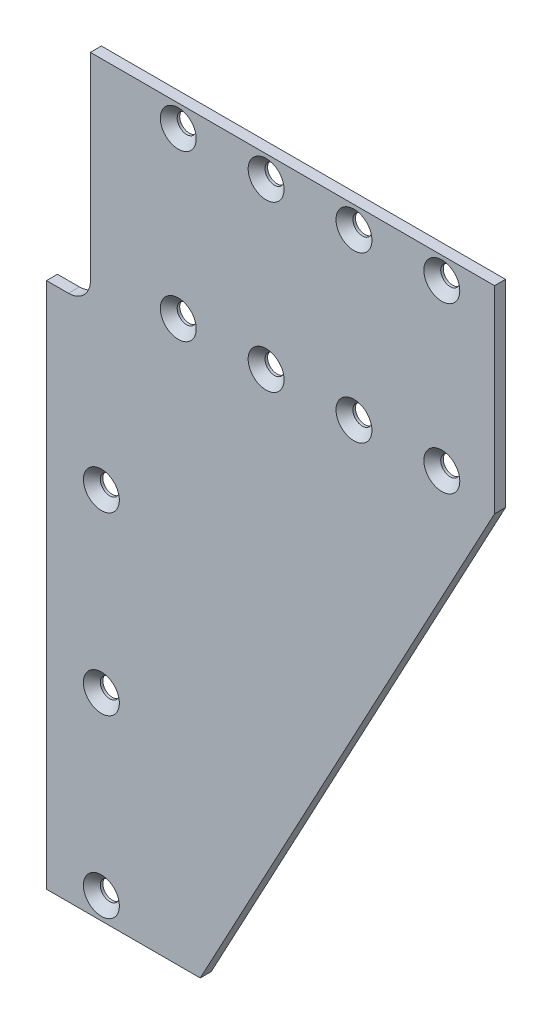
ISO-10303-21;
HEADER;
FILE_DESCRIPTION(('STEP AP214'),'2;1');
FILE_NAME('part.step','',(''),(''),'','','');
FILE_SCHEMA(('AUTOMOTIVE_DESIGN { 1 0 10303 214 1 1 1 1 }'));
ENDSEC;
DATA;
#1=APPLICATION_CONTEXT('core data for automotive mechanical design processes');
#2=APPLICATION_PROTOCOL_DEFINITION('international standard','automotive_design',2000,#1);
#3=PRODUCT_CONTEXT('',#1,'mechanical');
#4=PRODUCT('Part','Part','',(#3));
#5=PRODUCT_RELATED_PRODUCT_CATEGORY('part','',(#4));
#6=PRODUCT_DEFINITION_FORMATION('','',#4);
#7=PRODUCT_DEFINITION_CONTEXT('part definition',#1,'design');
#8=PRODUCT_DEFINITION('design','',#6,#7);
#9=PRODUCT_DEFINITION_SHAPE('','',#8);
#10=(LENGTH_UNIT() NAMED_UNIT(*) SI_UNIT(.MILLI.,.METRE.));
#11=(NAMED_UNIT(*) PLANE_ANGLE_UNIT() SI_UNIT($,.RADIAN.));
#12=(NAMED_UNIT(*) SI_UNIT($,.STERADIAN.) SOLID_ANGLE_UNIT());
#13=UNCERTAINTY_MEASURE_WITH_UNIT(LENGTH_MEASURE(1.E-05),#10,'distance_accuracy_value','');
#14=(GEOMETRIC_REPRESENTATION_CONTEXT(3) GLOBAL_UNCERTAINTY_ASSIGNED_CONTEXT((#13)) GLOBAL_UNIT_ASSIGNED_CONTEXT((#10,
#11,#12)) REPRESENTATION_CONTEXT('',''));
#15=CARTESIAN_POINT('',(0.,0.,0.));
#16=DIRECTION('',(0.,0.,1.));
#17=DIRECTION('',(1.,0.,0.));
#18=AXIS2_PLACEMENT_3D('',#15,#16,#17);
#19=CARTESIAN_POINT('',(6.35,158.75,0.));
#20=DIRECTION('',(0.,0.,-1.));
#21=DIRECTION('',(-1.,0.,0.));
#22=AXIS2_PLACEMENT_3D('',#19,#20,#21);
#23=PLANE('',#22);
#24=CARTESIAN_POINT('',(38.1,209.55,0.));
#25=DIRECTION('',(0.,0.,1.));
#26=DIRECTION('',(1.,0.,0.));
#27=AXIS2_PLACEMENT_3D('',#24,#25,#26);
#28=CIRCLE('',#27,5.1943);
#29=CARTESIAN_POINT('',(43.2943,209.55,0.));
#30=VERTEX_POINT('',#29);
#31=EDGE_CURVE('E366',#30,#30,#28,.T.);
#32=ORIENTED_EDGE('',*,*,#31,.F.);
#33=EDGE_LOOP('',(#32));
#34=FACE_BOUND('',#33,.T.);
#35=CARTESIAN_POINT('',(38.1,161.925,0.));
#36=DIRECTION('',(0.,0.,1.));
#37=DIRECTION('',(1.,0.,0.));
#38=AXIS2_PLACEMENT_3D('',#35,#36,#37);
#39=CIRCLE('',#38,5.1943);
#40=CARTESIAN_POINT('',(43.2943,161.925,0.));
#41=VERTEX_POINT('',#40);
#42=EDGE_CURVE('E375',#41,#41,#39,.T.);
#43=ORIENTED_EDGE('',*,*,#42,.F.);
#44=EDGE_LOOP('',(#43));
#45=FACE_BOUND('',#44,.T.);
#46=DIRECTION('',(1.,0.,0.));
#47=VECTOR('',#46,1.);
#48=CARTESIAN_POINT('',(44.45,0.,0.));
#49=LINE('',#48,#47);
#50=CARTESIAN_POINT('',(0.,0.,0.));
#51=VERTEX_POINT('',#50);
#52=CARTESIAN_POINT('',(44.45,0.,0.));
#53=VERTEX_POINT('',#52);
#54=EDGE_CURVE('E139',#51,#53,#49,.T.);
#55=ORIENTED_EDGE('',*,*,#54,.T.);
#56=DIRECTION('',(0.472417067906652,0.881375126691514,0.));
#57=VECTOR('',#56,1.);
#58=CARTESIAN_POINT('',(129.54,158.75,0.));
#59=LINE('',#58,#57);
#60=CARTESIAN_POINT('',(129.54,158.75,0.));
#61=VERTEX_POINT('',#60);
#62=EDGE_CURVE('E142',#53,#61,#59,.T.);
#63=ORIENTED_EDGE('',*,*,#62,.T.);
#64=DIRECTION('',(0.,1.,0.));
#65=VECTOR('',#64,1.);
#66=CARTESIAN_POINT('',(129.54,215.9,0.));
#67=LINE('',#66,#65);
#68=CARTESIAN_POINT('',(129.54,215.9,0.));
#69=VERTEX_POINT('',#68);
#70=EDGE_CURVE('E146',#61,#69,#67,.T.);
#71=ORIENTED_EDGE('',*,*,#70,.T.);
#72=DIRECTION('',(-1.,0.,0.));
#73=VECTOR('',#72,1.);
#74=CARTESIAN_POINT('',(12.7,215.9,0.));
#75=LINE('',#74,#73);
#76=CARTESIAN_POINT('',(12.7,215.9,0.));
#77=VERTEX_POINT('',#76);
#78=EDGE_CURVE('E149',#69,#77,#75,.T.);
#79=ORIENTED_EDGE('',*,*,#78,.T.);
#80=DIRECTION('',(0.,-1.,0.));
#81=VECTOR('',#80,1.);
#82=CARTESIAN_POINT('',(12.7,215.9,0.));
#83=LINE('',#82,#81);
#84=CARTESIAN_POINT('',(12.7,158.75,0.));
#85=VERTEX_POINT('',#84);
#86=EDGE_CURVE('E152',#77,#85,#83,.T.);
#87=ORIENTED_EDGE('',*,*,#86,.T.);
#88=CARTESIAN_POINT('',(6.35,158.75,0.));
#89=DIRECTION('',(0.,0.,-1.));
#90=DIRECTION('',(-1.,0.,0.));
#91=AXIS2_PLACEMENT_3D('',#88,#89,#90);
#92=CIRCLE('',#91,6.35);
#93=CARTESIAN_POINT('',(6.34999999999994,152.4,0.));
#94=VERTEX_POINT('',#93);
#95=EDGE_CURVE('E155',#85,#94,#92,.T.);
#96=ORIENTED_EDGE('',*,*,#95,.T.);
#97=DIRECTION('',(-1.,0.,0.));
#98=VECTOR('',#97,1.);
#99=CARTESIAN_POINT('',(6.34999999999994,152.4,0.));
#100=LINE('',#99,#98);
#101=CARTESIAN_POINT('',(0.,152.4,0.));
#102=VERTEX_POINT('',#101);
#103=EDGE_CURVE('E115',#94,#102,#100,.T.);
#104=ORIENTED_EDGE('',*,*,#103,.T.);
#105=DIRECTION('',(0.,-1.,0.));
#106=VECTOR('',#105,1.);
#107=CARTESIAN_POINT('',(0.,0.,0.));
#108=LINE('',#107,#106);
#109=EDGE_CURVE('E158',#102,#51,#108,.T.);
#110=ORIENTED_EDGE('',*,*,#109,.T.);
#111=EDGE_LOOP('',(#55,#63,#71,#79,#87,#96,#104,#110));
#112=FACE_BOUND('',#111,.T.);
#113=CARTESIAN_POINT('',(63.5,161.925,0.));
#114=DIRECTION('',(0.,0.,1.));
#115=DIRECTION('',(1.,0.,0.));
#116=AXIS2_PLACEMENT_3D('',#113,#114,#115);
#117=CIRCLE('',#116,5.1943);
#118=CARTESIAN_POINT('',(68.6943,161.925,0.));
#119=VERTEX_POINT('',#118);
#120=EDGE_CURVE('E357',#119,#119,#117,.T.);
#121=ORIENTED_EDGE('',*,*,#120,.F.);
#122=EDGE_LOOP('',(#121));
#123=FACE_BOUND('',#122,.T.);
#124=CARTESIAN_POINT('',(63.5,209.55,0.));
#125=DIRECTION('',(0.,0.,1.));
#126=DIRECTION('',(1.,0.,0.));
#127=AXIS2_PLACEMENT_3D('',#124,#125,#126);
#128=CIRCLE('',#127,5.1943);
#129=CARTESIAN_POINT('',(68.6943,209.55,0.));
#130=VERTEX_POINT('',#129);
#131=EDGE_CURVE('E348',#130,#130,#128,.T.);
#132=ORIENTED_EDGE('',*,*,#131,.F.);
#133=EDGE_LOOP('',(#132));
#134=FACE_BOUND('',#133,.T.);
#135=CARTESIAN_POINT('',(88.9,161.925,0.));
#136=DIRECTION('',(0.,0.,1.));
#137=DIRECTION('',(1.,0.,0.));
#138=AXIS2_PLACEMENT_3D('',#135,#136,#137);
#139=CIRCLE('',#138,5.1943);
#140=CARTESIAN_POINT('',(94.0943,161.925,0.));
#141=VERTEX_POINT('',#140);
#142=EDGE_CURVE('E339',#141,#141,#139,.T.);
#143=ORIENTED_EDGE('',*,*,#142,.F.);
#144=EDGE_LOOP('',(#143));
#145=FACE_BOUND('',#144,.T.);
#146=CARTESIAN_POINT('',(88.9,209.55,0.));
#147=DIRECTION('',(0.,0.,1.));
#148=DIRECTION('',(1.,0.,0.));
#149=AXIS2_PLACEMENT_3D('',#146,#147,#148);
#150=CIRCLE('',#149,5.1943);
#151=CARTESIAN_POINT('',(94.0943,209.55,0.));
#152=VERTEX_POINT('',#151);
#153=EDGE_CURVE('E330',#152,#152,#150,.T.);
#154=ORIENTED_EDGE('',*,*,#153,.F.);
#155=EDGE_LOOP('',(#154));
#156=FACE_BOUND('',#155,.T.);
#157=CARTESIAN_POINT('',(114.3,161.925,0.));
#158=DIRECTION('',(0.,0.,1.));
#159=DIRECTION('',(1.,0.,0.));
#160=AXIS2_PLACEMENT_3D('',#157,#158,#159);
#161=CIRCLE('',#160,5.1943);
#162=CARTESIAN_POINT('',(119.4943,161.925,0.));
#163=VERTEX_POINT('',#162);
#164=EDGE_CURVE('E321',#163,#163,#161,.T.);
#165=ORIENTED_EDGE('',*,*,#164,.F.);
#166=EDGE_LOOP('',(#165));
#167=FACE_BOUND('',#166,.T.);
#168=CARTESIAN_POINT('',(114.3,209.55,0.));
#169=DIRECTION('',(0.,0.,1.));
#170=DIRECTION('',(1.,0.,0.));
#171=AXIS2_PLACEMENT_3D('',#168,#169,#170);
#172=CIRCLE('',#171,5.1943);
#173=CARTESIAN_POINT('',(119.4943,209.55,0.));
#174=VERTEX_POINT('',#173);
#175=EDGE_CURVE('E312',#174,#174,#172,.T.);
#176=ORIENTED_EDGE('',*,*,#175,.F.);
#177=EDGE_LOOP('',(#176));
#178=FACE_BOUND('',#177,.T.);
#179=CARTESIAN_POINT('',(15.875,107.95,0.));
#180=DIRECTION('',(0.,0.,1.));
#181=DIRECTION('',(1.,0.,0.));
#182=AXIS2_PLACEMENT_3D('',#179,#180,#181);
#183=CIRCLE('',#182,5.1943);
#184=CARTESIAN_POINT('',(21.0693,107.95,0.));
#185=VERTEX_POINT('',#184);
#186=EDGE_CURVE('E303',#185,#185,#183,.T.);
#187=ORIENTED_EDGE('',*,*,#186,.F.);
#188=EDGE_LOOP('',(#187));
#189=FACE_BOUND('',#188,.T.);
#190=CARTESIAN_POINT('',(15.875,57.15,0.));
#191=DIRECTION('',(0.,0.,1.));
#192=DIRECTION('',(1.,0.,0.));
#193=AXIS2_PLACEMENT_3D('',#190,#191,#192);
#194=CIRCLE('',#193,5.1943);
#195=CARTESIAN_POINT('',(21.0693,57.15,0.));
#196=VERTEX_POINT('',#195);
#197=EDGE_CURVE('E294',#196,#196,#194,.T.);
#198=ORIENTED_EDGE('',*,*,#197,.F.);
#199=EDGE_LOOP('',(#198));
#200=FACE_BOUND('',#199,.T.);
#201=CARTESIAN_POINT('',(15.875,6.34999999999999,0.));
#202=DIRECTION('',(0.,0.,1.));
#203=DIRECTION('',(1.,0.,0.));
#204=AXIS2_PLACEMENT_3D('',#201,#202,#203);
#205=CIRCLE('',#204,5.1943);
#206=CARTESIAN_POINT('',(21.0693,6.34999999999999,0.));
#207=VERTEX_POINT('',#206);
#208=EDGE_CURVE('E286',#207,#207,#205,.T.);
#209=ORIENTED_EDGE('',*,*,#208,.F.);
#210=EDGE_LOOP('',(#209));
#211=FACE_BOUND('',#210,.T.);
#212=ADVANCED_FACE('F40',(#34,#45,#112,#123,#134,#145,#156,#167,#178,#189,#200,#211),#23,.F.);
#213=CARTESIAN_POINT('',(6.35,158.75,-3.175));
#214=DIRECTION('',(0.,0.,-1.));
#215=DIRECTION('',(-1.,0.,0.));
#216=AXIS2_PLACEMENT_3D('',#213,#214,#215);
#217=PLANE('',#216);
#218=CARTESIAN_POINT('',(114.3,161.925,-3.175));
#219=DIRECTION('',(0.,0.,1.));
#220=DIRECTION('',(1.,0.,0.));
#221=AXIS2_PLACEMENT_3D('',#218,#219,#220);
#222=CIRCLE('',#221,2.75590000000001);
#223=CARTESIAN_POINT('',(117.0559,161.925,-3.175));
#224=VERTEX_POINT('',#223);
#225=EDGE_CURVE('E327',#224,#224,#222,.T.);
#226=ORIENTED_EDGE('',*,*,#225,.T.);
#227=EDGE_LOOP('',(#226));
#228=FACE_BOUND('',#227,.T.);
#229=DIRECTION('',(1.,0.,0.));
#230=VECTOR('',#229,1.);
#231=CARTESIAN_POINT('',(44.45,0.,-3.175));
#232=LINE('',#231,#230);
#233=CARTESIAN_POINT('',(0.,0.,-3.175));
#234=VERTEX_POINT('',#233);
#235=CARTESIAN_POINT('',(44.45,0.,-3.175));
#236=VERTEX_POINT('',#235);
#237=EDGE_CURVE('E160',#234,#236,#232,.T.);
#238=ORIENTED_EDGE('',*,*,#237,.F.);
#239=DIRECTION('',(0.,-1.,0.));
#240=VECTOR('',#239,1.);
#241=CARTESIAN_POINT('',(0.,0.,-3.175));
#242=LINE('',#241,#240);
#243=CARTESIAN_POINT('',(0.,152.4,-3.175));
#244=VERTEX_POINT('',#243);
#245=EDGE_CURVE('E129',#244,#234,#242,.T.);
#246=ORIENTED_EDGE('',*,*,#245,.F.);
#247=DIRECTION('',(-1.,0.,0.));
#248=VECTOR('',#247,1.);
#249=CARTESIAN_POINT('',(6.34999999999994,152.4,-3.175));
#250=LINE('',#249,#248);
#251=CARTESIAN_POINT('',(6.34999999999994,152.4,-3.175));
#252=VERTEX_POINT('',#251);
#253=EDGE_CURVE('E113',#252,#244,#250,.T.);
#254=ORIENTED_EDGE('',*,*,#253,.F.);
#255=CARTESIAN_POINT('',(6.35,158.75,-3.175));
#256=DIRECTION('',(0.,0.,-1.));
#257=DIRECTION('',(-1.,0.,0.));
#258=AXIS2_PLACEMENT_3D('',#255,#256,#257);
#259=CIRCLE('',#258,6.35);
#260=CARTESIAN_POINT('',(12.7,158.75,-3.175));
#261=VERTEX_POINT('',#260);
#262=EDGE_CURVE('E127',#261,#252,#259,.T.);
#263=ORIENTED_EDGE('',*,*,#262,.F.);
#264=DIRECTION('',(0.,-1.,0.));
#265=VECTOR('',#264,1.);
#266=CARTESIAN_POINT('',(12.7,215.9,-3.175));
#267=LINE('',#266,#265);
#268=CARTESIAN_POINT('',(12.7,215.9,-3.175));
#269=VERTEX_POINT('',#268);
#270=EDGE_CURVE('E132',#269,#261,#267,.T.);
#271=ORIENTED_EDGE('',*,*,#270,.F.);
#272=DIRECTION('',(-1.,0.,0.));
#273=VECTOR('',#272,1.);
#274=CARTESIAN_POINT('',(12.7,215.9,-3.175));
#275=LINE('',#274,#273);
#276=CARTESIAN_POINT('',(129.54,215.9,-3.175));
#277=VERTEX_POINT('',#276);
#278=EDGE_CURVE('E134',#277,#269,#275,.T.);
#279=ORIENTED_EDGE('',*,*,#278,.F.);
#280=DIRECTION('',(0.,1.,0.));
#281=VECTOR('',#280,1.);
#282=CARTESIAN_POINT('',(129.54,215.9,-3.175));
#283=LINE('',#282,#281);
#284=CARTESIAN_POINT('',(129.54,158.75,-3.175));
#285=VERTEX_POINT('',#284);
#286=EDGE_CURVE('E386',#285,#277,#283,.T.);
#287=ORIENTED_EDGE('',*,*,#286,.F.);
#288=DIRECTION('',(0.472417067906652,0.881375126691514,0.));
#289=VECTOR('',#288,1.);
#290=CARTESIAN_POINT('',(129.54,158.75,-3.175));
#291=LINE('',#290,#289);
#292=EDGE_CURVE('E384',#236,#285,#291,.T.);
#293=ORIENTED_EDGE('',*,*,#292,.F.);
#294=EDGE_LOOP('',(#238,#246,#254,#263,#271,#279,#287,#293));
#295=FACE_BOUND('',#294,.T.);
#296=CARTESIAN_POINT('',(38.1,161.925,-3.175));
#297=DIRECTION('',(0.,0.,1.));
#298=DIRECTION('',(1.,0.,0.));
#299=AXIS2_PLACEMENT_3D('',#296,#297,#298);
#300=CIRCLE('',#299,2.7559);
#301=CARTESIAN_POINT('',(40.8559,161.925,-3.175));
#302=VERTEX_POINT('',#301);
#303=EDGE_CURVE('E143',#302,#302,#300,.T.);
#304=ORIENTED_EDGE('',*,*,#303,.T.);
#305=EDGE_LOOP('',(#304));
#306=FACE_BOUND('',#305,.T.);
#307=CARTESIAN_POINT('',(38.1,209.55,-3.175));
#308=DIRECTION('',(0.,0.,1.));
#309=DIRECTION('',(1.,0.,0.));
#310=AXIS2_PLACEMENT_3D('',#307,#308,#309);
#311=CIRCLE('',#310,2.7559);
#312=CARTESIAN_POINT('',(40.8559,209.55,-3.175));
#313=VERTEX_POINT('',#312);
#314=EDGE_CURVE('E372',#313,#313,#311,.T.);
#315=ORIENTED_EDGE('',*,*,#314,.T.);
#316=EDGE_LOOP('',(#315));
#317=FACE_BOUND('',#316,.T.);
#318=CARTESIAN_POINT('',(63.5,161.925,-3.175));
#319=DIRECTION('',(0.,0.,1.));
#320=DIRECTION('',(1.,0.,0.));
#321=AXIS2_PLACEMENT_3D('',#318,#319,#320);
#322=CIRCLE('',#321,2.75590000000001);
#323=CARTESIAN_POINT('',(66.2559,161.925,-3.175));
#324=VERTEX_POINT('',#323);
#325=EDGE_CURVE('E363',#324,#324,#322,.T.);
#326=ORIENTED_EDGE('',*,*,#325,.T.);
#327=EDGE_LOOP('',(#326));
#328=FACE_BOUND('',#327,.T.);
#329=CARTESIAN_POINT('',(63.5,209.55,-3.175));
#330=DIRECTION('',(0.,0.,1.));
#331=DIRECTION('',(1.,0.,0.));
#332=AXIS2_PLACEMENT_3D('',#329,#330,#331);
#333=CIRCLE('',#332,2.75590000000001);
#334=CARTESIAN_POINT('',(66.2559,209.55,-3.175));
#335=VERTEX_POINT('',#334);
#336=EDGE_CURVE('E354',#335,#335,#333,.T.);
#337=ORIENTED_EDGE('',*,*,#336,.T.);
#338=EDGE_LOOP('',(#337));
#339=FACE_BOUND('',#338,.T.);
#340=CARTESIAN_POINT('',(88.9,161.925,-3.175));
#341=DIRECTION('',(0.,0.,1.));
#342=DIRECTION('',(1.,0.,0.));
#343=AXIS2_PLACEMENT_3D('',#340,#341,#342);
#344=CIRCLE('',#343,2.75590000000001);
#345=CARTESIAN_POINT('',(91.6559,161.925,-3.175));
#346=VERTEX_POINT('',#345);
#347=EDGE_CURVE('E345',#346,#346,#344,.T.);
#348=ORIENTED_EDGE('',*,*,#347,.T.);
#349=EDGE_LOOP('',(#348));
#350=FACE_BOUND('',#349,.T.);
#351=CARTESIAN_POINT('',(88.9,209.55,-3.175));
#352=DIRECTION('',(0.,0.,1.));
#353=DIRECTION('',(1.,0.,0.));
#354=AXIS2_PLACEMENT_3D('',#351,#352,#353);
#355=CIRCLE('',#354,2.75590000000001);
#356=CARTESIAN_POINT('',(91.6559,209.55,-3.175));
#357=VERTEX_POINT('',#356);
#358=EDGE_CURVE('E336',#357,#357,#355,.T.);
#359=ORIENTED_EDGE('',*,*,#358,.T.);
#360=EDGE_LOOP('',(#359));
#361=FACE_BOUND('',#360,.T.);
#362=CARTESIAN_POINT('',(114.3,209.55,-3.175));
#363=DIRECTION('',(0.,0.,1.));
#364=DIRECTION('',(1.,0.,0.));
#365=AXIS2_PLACEMENT_3D('',#362,#363,#364);
#366=CIRCLE('',#365,2.75590000000001);
#367=CARTESIAN_POINT('',(117.0559,209.55,-3.175));
#368=VERTEX_POINT('',#367);
#369=EDGE_CURVE('E318',#368,#368,#366,.T.);
#370=ORIENTED_EDGE('',*,*,#369,.T.);
#371=EDGE_LOOP('',(#370));
#372=FACE_BOUND('',#371,.T.);
#373=CARTESIAN_POINT('',(15.875,107.95,-3.175));
#374=DIRECTION('',(0.,0.,1.));
#375=DIRECTION('',(1.,0.,0.));
#376=AXIS2_PLACEMENT_3D('',#373,#374,#375);
#377=CIRCLE('',#376,2.75589999999999);
#378=CARTESIAN_POINT('',(18.6309,107.95,-3.175));
#379=VERTEX_POINT('',#378);
#380=EDGE_CURVE('E309',#379,#379,#377,.T.);
#381=ORIENTED_EDGE('',*,*,#380,.T.);
#382=EDGE_LOOP('',(#381));
#383=FACE_BOUND('',#382,.T.);
#384=CARTESIAN_POINT('',(15.875,57.15,-3.175));
#385=DIRECTION('',(0.,0.,1.));
#386=DIRECTION('',(1.,0.,0.));
#387=AXIS2_PLACEMENT_3D('',#384,#385,#386);
#388=CIRCLE('',#387,2.75589999999999);
#389=CARTESIAN_POINT('',(18.6309,57.15,-3.175));
#390=VERTEX_POINT('',#389);
#391=EDGE_CURVE('E300',#390,#390,#388,.T.);
#392=ORIENTED_EDGE('',*,*,#391,.T.);
#393=EDGE_LOOP('',(#392));
#394=FACE_BOUND('',#393,.T.);
#395=CARTESIAN_POINT('',(15.875,6.34999999999999,-3.175));
#396=DIRECTION('',(0.,0.,1.));
#397=DIRECTION('',(1.,0.,0.));
#398=AXIS2_PLACEMENT_3D('',#395,#396,#397);
#399=CIRCLE('',#398,2.75589999999999);
#400=CARTESIAN_POINT('',(18.6309,6.34999999999999,-3.175));
#401=VERTEX_POINT('',#400);
#402=EDGE_CURVE('E289',#401,#401,#399,.T.);
#403=ORIENTED_EDGE('',*,*,#402,.T.);
#404=EDGE_LOOP('',(#403));
#405=FACE_BOUND('',#404,.T.);
#406=ADVANCED_FACE('F124',(#228,#295,#306,#317,#328,#339,#350,#361,#372,#383,#394,#405),#217,.T.);
#407=CARTESIAN_POINT('',(44.45,0.,-3.175));
#408=DIRECTION('',(0.,-1.,0.));
#409=DIRECTION('',(0.,0.,-1.));
#410=AXIS2_PLACEMENT_3D('',#407,#408,#409);
#411=PLANE('',#410);
#412=ORIENTED_EDGE('',*,*,#54,.F.);
#413=DIRECTION('',(0.,0.,1.));
#414=VECTOR('',#413,1.);
#415=CARTESIAN_POINT('',(0.,0.,-3.175));
#416=LINE('',#415,#414);
#417=EDGE_CURVE('E11',#234,#51,#416,.T.);
#418=ORIENTED_EDGE('',*,*,#417,.F.);
#419=ORIENTED_EDGE('',*,*,#237,.T.);
#420=DIRECTION('',(0.,0.,1.));
#421=VECTOR('',#420,1.);
#422=CARTESIAN_POINT('',(44.45,0.,-3.175));
#423=LINE('',#422,#421);
#424=EDGE_CURVE('E44',#236,#53,#423,.T.);
#425=ORIENTED_EDGE('',*,*,#424,.T.);
#426=EDGE_LOOP('',(#412,#418,#419,#425));
#427=FACE_BOUND('',#426,.T.);
#428=ADVANCED_FACE('F42',(#427),#411,.T.);
#429=CARTESIAN_POINT('',(0.,0.,-3.175));
#430=DIRECTION('',(-1.,0.,0.));
#431=DIRECTION('',(0.,0.,1.));
#432=AXIS2_PLACEMENT_3D('',#429,#430,#431);
#433=PLANE('',#432);
#434=ORIENTED_EDGE('',*,*,#109,.F.);
#435=DIRECTION('',(0.,0.,1.));
#436=VECTOR('',#435,1.);
#437=CARTESIAN_POINT('',(0.,152.4,-3.175));
#438=LINE('',#437,#436);
#439=EDGE_CURVE('E50',#244,#102,#438,.T.);
#440=ORIENTED_EDGE('',*,*,#439,.F.);
#441=ORIENTED_EDGE('',*,*,#245,.T.);
#442=ORIENTED_EDGE('',*,*,#417,.T.);
#443=EDGE_LOOP('',(#434,#440,#441,#442));
#444=FACE_BOUND('',#443,.T.);
#445=ADVANCED_FACE('F172',(#444),#433,.T.);
#446=CARTESIAN_POINT('',(6.34999999999994,152.4,-3.175));
#447=DIRECTION('',(0.,1.,0.));
#448=DIRECTION('',(0.,0.,1.));
#449=AXIS2_PLACEMENT_3D('',#446,#447,#448);
#450=PLANE('',#449);
#451=ORIENTED_EDGE('',*,*,#103,.F.);
#452=DIRECTION('',(0.,0.,1.));
#453=VECTOR('',#452,1.);
#454=CARTESIAN_POINT('',(6.34999999999994,152.4,-3.175));
#455=LINE('',#454,#453);
#456=EDGE_CURVE('E110',#252,#94,#455,.T.);
#457=ORIENTED_EDGE('',*,*,#456,.F.);
#458=ORIENTED_EDGE('',*,*,#253,.T.);
#459=ORIENTED_EDGE('',*,*,#439,.T.);
#460=EDGE_LOOP('',(#451,#457,#458,#459));
#461=FACE_BOUND('',#460,.T.);
#462=ADVANCED_FACE('F112',(#461),#450,.T.);
#463=CARTESIAN_POINT('',(6.35,158.75,-3.175));
#464=DIRECTION('',(0.,0.,1.));
#465=DIRECTION('',(1.,0.,0.));
#466=AXIS2_PLACEMENT_3D('',#463,#464,#465);
#467=CYLINDRICAL_SURFACE('',#466,6.35);
#468=ORIENTED_EDGE('',*,*,#95,.F.);
#469=DIRECTION('',(0.,0.,1.));
#470=VECTOR('',#469,1.);
#471=CARTESIAN_POINT('',(12.7,158.75,-3.175));
#472=LINE('',#471,#470);
#473=EDGE_CURVE('E120',#261,#85,#472,.T.);
#474=ORIENTED_EDGE('',*,*,#473,.F.);
#475=ORIENTED_EDGE('',*,*,#262,.T.);
#476=ORIENTED_EDGE('',*,*,#456,.T.);
#477=EDGE_LOOP('',(#468,#474,#475,#476));
#478=FACE_BOUND('',#477,.T.);
#479=ADVANCED_FACE('F131',(#478),#467,.F.);
#480=CARTESIAN_POINT('',(12.7,215.9,-3.175));
#481=DIRECTION('',(-1.,0.,0.));
#482=DIRECTION('',(0.,-1.,0.));
#483=AXIS2_PLACEMENT_3D('',#480,#481,#482);
#484=PLANE('',#483);
#485=ORIENTED_EDGE('',*,*,#86,.F.);
#486=DIRECTION('',(0.,0.,1.));
#487=VECTOR('',#486,1.);
#488=CARTESIAN_POINT('',(12.7,215.9,-3.175));
#489=LINE('',#488,#487);
#490=EDGE_CURVE('E164',#269,#77,#489,.T.);
#491=ORIENTED_EDGE('',*,*,#490,.F.);
#492=ORIENTED_EDGE('',*,*,#270,.T.);
#493=ORIENTED_EDGE('',*,*,#473,.T.);
#494=EDGE_LOOP('',(#485,#491,#492,#493));
#495=FACE_BOUND('',#494,.T.);
#496=ADVANCED_FACE('F398',(#495),#484,.T.);
#497=CARTESIAN_POINT('',(12.7,215.9,-3.175));
#498=DIRECTION('',(0.,1.,0.));
#499=DIRECTION('',(-1.,0.,0.));
#500=AXIS2_PLACEMENT_3D('',#497,#498,#499);
#501=PLANE('',#500);
#502=ORIENTED_EDGE('',*,*,#78,.F.);
#503=DIRECTION('',(0.,0.,1.));
#504=VECTOR('',#503,1.);
#505=CARTESIAN_POINT('',(129.54,215.9,-3.175));
#506=LINE('',#505,#504);
#507=EDGE_CURVE('E166',#277,#69,#506,.T.);
#508=ORIENTED_EDGE('',*,*,#507,.F.);
#509=ORIENTED_EDGE('',*,*,#278,.T.);
#510=ORIENTED_EDGE('',*,*,#490,.T.);
#511=EDGE_LOOP('',(#502,#508,#509,#510));
#512=FACE_BOUND('',#511,.T.);
#513=ADVANCED_FACE('F392',(#512),#501,.T.);
#514=CARTESIAN_POINT('',(129.54,215.9,-3.175));
#515=DIRECTION('',(1.,0.,0.));
#516=DIRECTION('',(0.,1.,0.));
#517=AXIS2_PLACEMENT_3D('',#514,#515,#516);
#518=PLANE('',#517);
#519=ORIENTED_EDGE('',*,*,#70,.F.);
#520=DIRECTION('',(0.,0.,1.));
#521=VECTOR('',#520,1.);
#522=CARTESIAN_POINT('',(129.54,158.75,-3.175));
#523=LINE('',#522,#521);
#524=EDGE_CURVE('E167',#285,#61,#523,.T.);
#525=ORIENTED_EDGE('',*,*,#524,.F.);
#526=ORIENTED_EDGE('',*,*,#286,.T.);
#527=ORIENTED_EDGE('',*,*,#507,.T.);
#528=EDGE_LOOP('',(#519,#525,#526,#527));
#529=FACE_BOUND('',#528,.T.);
#530=ADVANCED_FACE('F396',(#529),#518,.T.);
#531=CARTESIAN_POINT('',(129.54,158.75,-3.175));
#532=DIRECTION('',(0.881375126691514,-0.472417067906652,0.));
#533=DIRECTION('',(0.472417067906652,0.881375126691514,0.));
#534=AXIS2_PLACEMENT_3D('',#531,#532,#533);
#535=PLANE('',#534);
#536=ORIENTED_EDGE('',*,*,#62,.F.);
#537=ORIENTED_EDGE('',*,*,#424,.F.);
#538=ORIENTED_EDGE('',*,*,#292,.T.);
#539=ORIENTED_EDGE('',*,*,#524,.T.);
#540=EDGE_LOOP('',(#536,#537,#538,#539));
#541=FACE_BOUND('',#540,.T.);
#542=ADVANCED_FACE('F169',(#541),#535,.T.);
#543=CARTESIAN_POINT('',(38.1,161.925,0.));
#544=DIRECTION('',(0.,0.,1.));
#545=DIRECTION('',(1.,0.,0.));
#546=AXIS2_PLACEMENT_3D('',#543,#544,#545);
#547=CYLINDRICAL_SURFACE('',#546,2.7559);
#548=ORIENTED_EDGE('',*,*,#303,.F.);
#549=EDGE_LOOP('',(#548));
#550=FACE_BOUND('',#549,.T.);
#551=CARTESIAN_POINT('',(38.1,161.925,-2.4384));
#552=DIRECTION('',(0.,0.,1.));
#553=DIRECTION('',(1.,0.,0.));
#554=AXIS2_PLACEMENT_3D('',#551,#552,#553);
#555=CIRCLE('',#554,2.7559);
#556=CARTESIAN_POINT('',(40.8559,161.925,-2.4384));
#557=VERTEX_POINT('',#556);
#558=EDGE_CURVE('E378',#557,#557,#555,.T.);
#559=ORIENTED_EDGE('',*,*,#558,.T.);
#560=EDGE_LOOP('',(#559));
#561=FACE_BOUND('',#560,.T.);
#562=ADVANCED_FACE('F191',(#550,#561),#547,.F.);
#563=CARTESIAN_POINT('',(38.1,161.925,0.));
#564=DIRECTION('',(0.,0.,1.));
#565=DIRECTION('',(1.,0.,0.));
#566=AXIS2_PLACEMENT_3D('',#563,#564,#565);
#567=CONICAL_SURFACE('',#566,5.1943,0.785398163397449);
#568=ORIENTED_EDGE('',*,*,#558,.F.);
#569=EDGE_LOOP('',(#568));
#570=FACE_BOUND('',#569,.T.);
#571=ORIENTED_EDGE('',*,*,#42,.T.);
#572=EDGE_LOOP('',(#571));
#573=FACE_BOUND('',#572,.T.);
#574=ADVANCED_FACE('F194',(#570,#573),#567,.F.);
#575=CARTESIAN_POINT('',(38.1,209.55,0.));
#576=DIRECTION('',(0.,0.,1.));
#577=DIRECTION('',(1.,0.,0.));
#578=AXIS2_PLACEMENT_3D('',#575,#576,#577);
#579=CYLINDRICAL_SURFACE('',#578,2.7559);
#580=ORIENTED_EDGE('',*,*,#314,.F.);
#581=EDGE_LOOP('',(#580));
#582=FACE_BOUND('',#581,.T.);
#583=CARTESIAN_POINT('',(38.1,209.55,-2.4384));
#584=DIRECTION('',(0.,0.,1.));
#585=DIRECTION('',(1.,0.,0.));
#586=AXIS2_PLACEMENT_3D('',#583,#584,#585);
#587=CIRCLE('',#586,2.7559);
#588=CARTESIAN_POINT('',(40.8559,209.55,-2.4384));
#589=VERTEX_POINT('',#588);
#590=EDGE_CURVE('E369',#589,#589,#587,.T.);
#591=ORIENTED_EDGE('',*,*,#590,.T.);
#592=EDGE_LOOP('',(#591));
#593=FACE_BOUND('',#592,.T.);
#594=ADVANCED_FACE('F198',(#582,#593),#579,.F.);
#595=CARTESIAN_POINT('',(38.1,209.55,0.));
#596=DIRECTION('',(0.,0.,1.));
#597=DIRECTION('',(1.,0.,0.));
#598=AXIS2_PLACEMENT_3D('',#595,#596,#597);
#599=CONICAL_SURFACE('',#598,5.1943,0.785398163397449);
#600=ORIENTED_EDGE('',*,*,#590,.F.);
#601=EDGE_LOOP('',(#600));
#602=FACE_BOUND('',#601,.T.);
#603=ORIENTED_EDGE('',*,*,#31,.T.);
#604=EDGE_LOOP('',(#603));
#605=FACE_BOUND('',#604,.T.);
#606=ADVANCED_FACE('F202',(#602,#605),#599,.F.);
#607=CARTESIAN_POINT('',(63.5,161.925,0.));
#608=DIRECTION('',(0.,0.,1.));
#609=DIRECTION('',(1.,0.,0.));
#610=AXIS2_PLACEMENT_3D('',#607,#608,#609);
#611=CYLINDRICAL_SURFACE('',#610,2.75590000000001);
#612=ORIENTED_EDGE('',*,*,#325,.F.);
#613=EDGE_LOOP('',(#612));
#614=FACE_BOUND('',#613,.T.);
#615=CARTESIAN_POINT('',(63.5,161.925,-2.4384));
#616=DIRECTION('',(0.,0.,1.));
#617=DIRECTION('',(1.,0.,0.));
#618=AXIS2_PLACEMENT_3D('',#615,#616,#617);
#619=CIRCLE('',#618,2.75590000000001);
#620=CARTESIAN_POINT('',(66.2559,161.925,-2.4384));
#621=VERTEX_POINT('',#620);
#622=EDGE_CURVE('E360',#621,#621,#619,.T.);
#623=ORIENTED_EDGE('',*,*,#622,.T.);
#624=EDGE_LOOP('',(#623));
#625=FACE_BOUND('',#624,.T.);
#626=ADVANCED_FACE('F206',(#614,#625),#611,.F.);
#627=CARTESIAN_POINT('',(63.5,161.925,0.));
#628=DIRECTION('',(0.,0.,1.));
#629=DIRECTION('',(1.,0.,0.));
#630=AXIS2_PLACEMENT_3D('',#627,#628,#629);
#631=CONICAL_SURFACE('',#630,5.1943,0.785398163397447);
#632=ORIENTED_EDGE('',*,*,#622,.F.);
#633=EDGE_LOOP('',(#632));
#634=FACE_BOUND('',#633,.T.);
#635=ORIENTED_EDGE('',*,*,#120,.T.);
#636=EDGE_LOOP('',(#635));
#637=FACE_BOUND('',#636,.T.);
#638=ADVANCED_FACE('F210',(#634,#637),#631,.F.);
#639=CARTESIAN_POINT('',(63.5,209.55,0.));
#640=DIRECTION('',(0.,0.,1.));
#641=DIRECTION('',(1.,0.,0.));
#642=AXIS2_PLACEMENT_3D('',#639,#640,#641);
#643=CYLINDRICAL_SURFACE('',#642,2.75590000000001);
#644=ORIENTED_EDGE('',*,*,#336,.F.);
#645=EDGE_LOOP('',(#644));
#646=FACE_BOUND('',#645,.T.);
#647=CARTESIAN_POINT('',(63.5,209.55,-2.4384));
#648=DIRECTION('',(0.,0.,1.));
#649=DIRECTION('',(1.,0.,0.));
#650=AXIS2_PLACEMENT_3D('',#647,#648,#649);
#651=CIRCLE('',#650,2.75590000000001);
#652=CARTESIAN_POINT('',(66.2559,209.55,-2.4384));
#653=VERTEX_POINT('',#652);
#654=EDGE_CURVE('E351',#653,#653,#651,.T.);
#655=ORIENTED_EDGE('',*,*,#654,.T.);
#656=EDGE_LOOP('',(#655));
#657=FACE_BOUND('',#656,.T.);
#658=ADVANCED_FACE('F214',(#646,#657),#643,.F.);
#659=CARTESIAN_POINT('',(63.5,209.55,0.));
#660=DIRECTION('',(0.,0.,1.));
#661=DIRECTION('',(1.,0.,0.));
#662=AXIS2_PLACEMENT_3D('',#659,#660,#661);
#663=CONICAL_SURFACE('',#662,5.1943,0.785398163397447);
#664=ORIENTED_EDGE('',*,*,#654,.F.);
#665=EDGE_LOOP('',(#664));
#666=FACE_BOUND('',#665,.T.);
#667=ORIENTED_EDGE('',*,*,#131,.T.);
#668=EDGE_LOOP('',(#667));
#669=FACE_BOUND('',#668,.T.);
#670=ADVANCED_FACE('F218',(#666,#669),#663,.F.);
#671=CARTESIAN_POINT('',(88.9,161.925,0.));
#672=DIRECTION('',(0.,0.,1.));
#673=DIRECTION('',(1.,0.,0.));
#674=AXIS2_PLACEMENT_3D('',#671,#672,#673);
#675=CYLINDRICAL_SURFACE('',#674,2.75590000000001);
#676=ORIENTED_EDGE('',*,*,#347,.F.);
#677=EDGE_LOOP('',(#676));
#678=FACE_BOUND('',#677,.T.);
#679=CARTESIAN_POINT('',(88.9,161.925,-2.4384));
#680=DIRECTION('',(0.,0.,1.));
#681=DIRECTION('',(1.,0.,0.));
#682=AXIS2_PLACEMENT_3D('',#679,#680,#681);
#683=CIRCLE('',#682,2.75590000000001);
#684=CARTESIAN_POINT('',(91.6559,161.925,-2.4384));
#685=VERTEX_POINT('',#684);
#686=EDGE_CURVE('E342',#685,#685,#683,.T.);
#687=ORIENTED_EDGE('',*,*,#686,.T.);
#688=EDGE_LOOP('',(#687));
#689=FACE_BOUND('',#688,.T.);
#690=ADVANCED_FACE('F222',(#678,#689),#675,.F.);
#691=CARTESIAN_POINT('',(88.9,161.925,0.));
#692=DIRECTION('',(0.,0.,1.));
#693=DIRECTION('',(1.,0.,0.));
#694=AXIS2_PLACEMENT_3D('',#691,#692,#693);
#695=CONICAL_SURFACE('',#694,5.1943,0.785398163397447);
#696=ORIENTED_EDGE('',*,*,#686,.F.);
#697=EDGE_LOOP('',(#696));
#698=FACE_BOUND('',#697,.T.);
#699=ORIENTED_EDGE('',*,*,#142,.T.);
#700=EDGE_LOOP('',(#699));
#701=FACE_BOUND('',#700,.T.);
#702=ADVANCED_FACE('F226',(#698,#701),#695,.F.);
#703=CARTESIAN_POINT('',(88.9,209.55,0.));
#704=DIRECTION('',(0.,0.,1.));
#705=DIRECTION('',(1.,0.,0.));
#706=AXIS2_PLACEMENT_3D('',#703,#704,#705);
#707=CYLINDRICAL_SURFACE('',#706,2.75590000000001);
#708=ORIENTED_EDGE('',*,*,#358,.F.);
#709=EDGE_LOOP('',(#708));
#710=FACE_BOUND('',#709,.T.);
#711=CARTESIAN_POINT('',(88.9,209.55,-2.4384));
#712=DIRECTION('',(0.,0.,1.));
#713=DIRECTION('',(1.,0.,0.));
#714=AXIS2_PLACEMENT_3D('',#711,#712,#713);
#715=CIRCLE('',#714,2.75590000000001);
#716=CARTESIAN_POINT('',(91.6559,209.55,-2.4384));
#717=VERTEX_POINT('',#716);
#718=EDGE_CURVE('E333',#717,#717,#715,.T.);
#719=ORIENTED_EDGE('',*,*,#718,.T.);
#720=EDGE_LOOP('',(#719));
#721=FACE_BOUND('',#720,.T.);
#722=ADVANCED_FACE('F230',(#710,#721),#707,.F.);
#723=CARTESIAN_POINT('',(88.9,209.55,0.));
#724=DIRECTION('',(0.,0.,1.));
#725=DIRECTION('',(1.,0.,0.));
#726=AXIS2_PLACEMENT_3D('',#723,#724,#725);
#727=CONICAL_SURFACE('',#726,5.1943,0.785398163397447);
#728=ORIENTED_EDGE('',*,*,#718,.F.);
#729=EDGE_LOOP('',(#728));
#730=FACE_BOUND('',#729,.T.);
#731=ORIENTED_EDGE('',*,*,#153,.T.);
#732=EDGE_LOOP('',(#731));
#733=FACE_BOUND('',#732,.T.);
#734=ADVANCED_FACE('F234',(#730,#733),#727,.F.);
#735=CARTESIAN_POINT('',(114.3,161.925,0.));
#736=DIRECTION('',(0.,0.,1.));
#737=DIRECTION('',(1.,0.,0.));
#738=AXIS2_PLACEMENT_3D('',#735,#736,#737);
#739=CYLINDRICAL_SURFACE('',#738,2.75590000000001);
#740=ORIENTED_EDGE('',*,*,#225,.F.);
#741=EDGE_LOOP('',(#740));
#742=FACE_BOUND('',#741,.T.);
#743=CARTESIAN_POINT('',(114.3,161.925,-2.4384));
#744=DIRECTION('',(0.,0.,1.));
#745=DIRECTION('',(1.,0.,0.));
#746=AXIS2_PLACEMENT_3D('',#743,#744,#745);
#747=CIRCLE('',#746,2.75590000000001);
#748=CARTESIAN_POINT('',(117.0559,161.925,-2.4384));
#749=VERTEX_POINT('',#748);
#750=EDGE_CURVE('E324',#749,#749,#747,.T.);
#751=ORIENTED_EDGE('',*,*,#750,.T.);
#752=EDGE_LOOP('',(#751));
#753=FACE_BOUND('',#752,.T.);
#754=ADVANCED_FACE('F238',(#742,#753),#739,.F.);
#755=CARTESIAN_POINT('',(114.3,161.925,0.));
#756=DIRECTION('',(0.,0.,1.));
#757=DIRECTION('',(1.,0.,0.));
#758=AXIS2_PLACEMENT_3D('',#755,#756,#757);
#759=CONICAL_SURFACE('',#758,5.1943,0.785398163397447);
#760=ORIENTED_EDGE('',*,*,#750,.F.);
#761=EDGE_LOOP('',(#760));
#762=FACE_BOUND('',#761,.T.);
#763=ORIENTED_EDGE('',*,*,#164,.T.);
#764=EDGE_LOOP('',(#763));
#765=FACE_BOUND('',#764,.T.);
#766=ADVANCED_FACE('F242',(#762,#765),#759,.F.);
#767=CARTESIAN_POINT('',(114.3,209.55,0.));
#768=DIRECTION('',(0.,0.,1.));
#769=DIRECTION('',(1.,0.,0.));
#770=AXIS2_PLACEMENT_3D('',#767,#768,#769);
#771=CYLINDRICAL_SURFACE('',#770,2.75590000000001);
#772=ORIENTED_EDGE('',*,*,#369,.F.);
#773=EDGE_LOOP('',(#772));
#774=FACE_BOUND('',#773,.T.);
#775=CARTESIAN_POINT('',(114.3,209.55,-2.4384));
#776=DIRECTION('',(0.,0.,1.));
#777=DIRECTION('',(1.,0.,0.));
#778=AXIS2_PLACEMENT_3D('',#775,#776,#777);
#779=CIRCLE('',#778,2.75590000000001);
#780=CARTESIAN_POINT('',(117.0559,209.55,-2.4384));
#781=VERTEX_POINT('',#780);
#782=EDGE_CURVE('E315',#781,#781,#779,.T.);
#783=ORIENTED_EDGE('',*,*,#782,.T.);
#784=EDGE_LOOP('',(#783));
#785=FACE_BOUND('',#784,.T.);
#786=ADVANCED_FACE('F246',(#774,#785),#771,.F.);
#787=CARTESIAN_POINT('',(114.3,209.55,0.));
#788=DIRECTION('',(0.,0.,1.));
#789=DIRECTION('',(1.,0.,0.));
#790=AXIS2_PLACEMENT_3D('',#787,#788,#789);
#791=CONICAL_SURFACE('',#790,5.1943,0.785398163397447);
#792=ORIENTED_EDGE('',*,*,#782,.F.);
#793=EDGE_LOOP('',(#792));
#794=FACE_BOUND('',#793,.T.);
#795=ORIENTED_EDGE('',*,*,#175,.T.);
#796=EDGE_LOOP('',(#795));
#797=FACE_BOUND('',#796,.T.);
#798=ADVANCED_FACE('F250',(#794,#797),#791,.F.);
#799=CARTESIAN_POINT('',(15.875,107.95,0.));
#800=DIRECTION('',(0.,0.,1.));
#801=DIRECTION('',(1.,0.,0.));
#802=AXIS2_PLACEMENT_3D('',#799,#800,#801);
#803=CYLINDRICAL_SURFACE('',#802,2.75589999999999);
#804=ORIENTED_EDGE('',*,*,#380,.F.);
#805=EDGE_LOOP('',(#804));
#806=FACE_BOUND('',#805,.T.);
#807=CARTESIAN_POINT('',(15.875,107.95,-2.43840000000001));
#808=DIRECTION('',(0.,0.,1.));
#809=DIRECTION('',(1.,0.,0.));
#810=AXIS2_PLACEMENT_3D('',#807,#808,#809);
#811=CIRCLE('',#810,2.75589999999999);
#812=CARTESIAN_POINT('',(18.6309,107.95,-2.43840000000001));
#813=VERTEX_POINT('',#812);
#814=EDGE_CURVE('E306',#813,#813,#811,.T.);
#815=ORIENTED_EDGE('',*,*,#814,.T.);
#816=EDGE_LOOP('',(#815));
#817=FACE_BOUND('',#816,.T.);
#818=ADVANCED_FACE('F254',(#806,#817),#803,.F.);
#819=CARTESIAN_POINT('',(15.875,107.95,0.));
#820=DIRECTION('',(0.,0.,1.));
#821=DIRECTION('',(1.,0.,0.));
#822=AXIS2_PLACEMENT_3D('',#819,#820,#821);
#823=CONICAL_SURFACE('',#822,5.1943,0.785398163397449);
#824=ORIENTED_EDGE('',*,*,#814,.F.);
#825=EDGE_LOOP('',(#824));
#826=FACE_BOUND('',#825,.T.);
#827=ORIENTED_EDGE('',*,*,#186,.T.);
#828=EDGE_LOOP('',(#827));
#829=FACE_BOUND('',#828,.T.);
#830=ADVANCED_FACE('F258',(#826,#829),#823,.F.);
#831=CARTESIAN_POINT('',(15.875,57.15,0.));
#832=DIRECTION('',(0.,0.,1.));
#833=DIRECTION('',(1.,0.,0.));
#834=AXIS2_PLACEMENT_3D('',#831,#832,#833);
#835=CYLINDRICAL_SURFACE('',#834,2.75589999999999);
#836=ORIENTED_EDGE('',*,*,#391,.F.);
#837=EDGE_LOOP('',(#836));
#838=FACE_BOUND('',#837,.T.);
#839=CARTESIAN_POINT('',(15.875,57.15,-2.43840000000001));
#840=DIRECTION('',(0.,0.,1.));
#841=DIRECTION('',(1.,0.,0.));
#842=AXIS2_PLACEMENT_3D('',#839,#840,#841);
#843=CIRCLE('',#842,2.75589999999999);
#844=CARTESIAN_POINT('',(18.6309,57.15,-2.43840000000001));
#845=VERTEX_POINT('',#844);
#846=EDGE_CURVE('E297',#845,#845,#843,.T.);
#847=ORIENTED_EDGE('',*,*,#846,.T.);
#848=EDGE_LOOP('',(#847));
#849=FACE_BOUND('',#848,.T.);
#850=ADVANCED_FACE('F262',(#838,#849),#835,.F.);
#851=CARTESIAN_POINT('',(15.875,57.15,0.));
#852=DIRECTION('',(0.,0.,1.));
#853=DIRECTION('',(1.,0.,0.));
#854=AXIS2_PLACEMENT_3D('',#851,#852,#853);
#855=CONICAL_SURFACE('',#854,5.1943,0.785398163397449);
#856=ORIENTED_EDGE('',*,*,#846,.F.);
#857=EDGE_LOOP('',(#856));
#858=FACE_BOUND('',#857,.T.);
#859=ORIENTED_EDGE('',*,*,#197,.T.);
#860=EDGE_LOOP('',(#859));
#861=FACE_BOUND('',#860,.T.);
#862=ADVANCED_FACE('F266',(#858,#861),#855,.F.);
#863=CARTESIAN_POINT('',(15.875,6.34999999999999,0.));
#864=DIRECTION('',(0.,0.,1.));
#865=DIRECTION('',(1.,0.,0.));
#866=AXIS2_PLACEMENT_3D('',#863,#864,#865);
#867=CYLINDRICAL_SURFACE('',#866,2.75589999999999);
#868=ORIENTED_EDGE('',*,*,#402,.F.);
#869=EDGE_LOOP('',(#868));
#870=FACE_BOUND('',#869,.T.);
#871=CARTESIAN_POINT('',(15.875,6.34999999999999,-2.43840000000001));
#872=DIRECTION('',(0.,0.,1.));
#873=DIRECTION('',(1.,0.,0.));
#874=AXIS2_PLACEMENT_3D('',#871,#872,#873);
#875=CIRCLE('',#874,2.75589999999999);
#876=CARTESIAN_POINT('',(18.6309,6.34999999999999,-2.43840000000001));
#877=VERTEX_POINT('',#876);
#878=EDGE_CURVE('E283',#877,#877,#875,.T.);
#879=ORIENTED_EDGE('',*,*,#878,.T.);
#880=EDGE_LOOP('',(#879));
#881=FACE_BOUND('',#880,.T.);
#882=ADVANCED_FACE('F270',(#870,#881),#867,.F.);
#883=CARTESIAN_POINT('',(15.875,6.34999999999999,0.));
#884=DIRECTION('',(0.,0.,1.));
#885=DIRECTION('',(1.,0.,0.));
#886=AXIS2_PLACEMENT_3D('',#883,#884,#885);
#887=CONICAL_SURFACE('',#886,5.1943,0.785398163397449);
#888=ORIENTED_EDGE('',*,*,#878,.F.);
#889=EDGE_LOOP('',(#888));
#890=FACE_BOUND('',#889,.T.);
#891=ORIENTED_EDGE('',*,*,#208,.T.);
#892=EDGE_LOOP('',(#891));
#893=FACE_BOUND('',#892,.T.);
#894=ADVANCED_FACE('F274',(#890,#893),#887,.F.);
#895=CLOSED_SHELL('',(#212,#406,#428,#445,#462,#479,#496,#513,#530,#542,#562,#574,#594,#606,
#626,#638,#658,#670,#690,#702,#722,#734,#754,#766,#786,#798,#818,#830,#850,#862,#882,#894));
#896=MANIFOLD_SOLID_BREP('B2',#895);
#897=ADVANCED_BREP_SHAPE_REPRESENTATION('',(#18,#896),#14);
#898=SHAPE_DEFINITION_REPRESENTATION(#9,#897);
ENDSEC;
END-ISO-10303-21;
